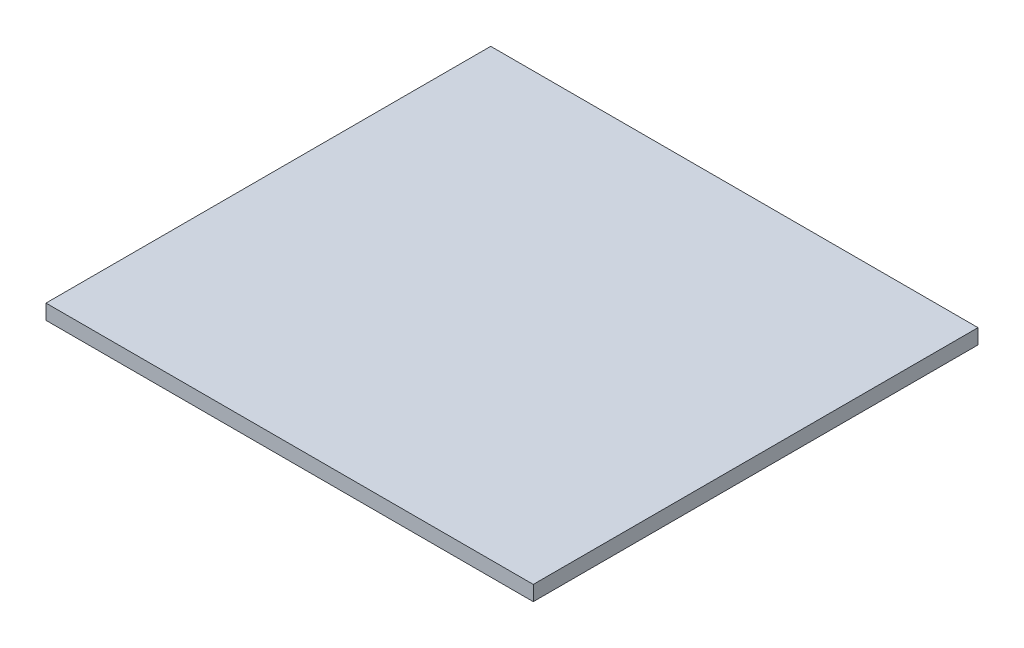
ISO-10303-21;
HEADER;
FILE_DESCRIPTION(('STEP AP214'),'2;1');
FILE_NAME('part.step','',(''),(''),'','','');
FILE_SCHEMA(('AUTOMOTIVE_DESIGN { 1 0 10303 214 1 1 1 1 }'));
ENDSEC;
DATA;
#1=APPLICATION_CONTEXT('core data for automotive mechanical design processes');
#2=APPLICATION_PROTOCOL_DEFINITION('international standard','automotive_design',2000,#1);
#3=PRODUCT_CONTEXT('',#1,'mechanical');
#4=PRODUCT('Part','Part','',(#3));
#5=PRODUCT_RELATED_PRODUCT_CATEGORY('part','',(#4));
#6=PRODUCT_DEFINITION_FORMATION('','',#4);
#7=PRODUCT_DEFINITION_CONTEXT('part definition',#1,'design');
#8=PRODUCT_DEFINITION('design','',#6,#7);
#9=PRODUCT_DEFINITION_SHAPE('','',#8);
#10=(LENGTH_UNIT() NAMED_UNIT(*) SI_UNIT(.MILLI.,.METRE.));
#11=(NAMED_UNIT(*) PLANE_ANGLE_UNIT() SI_UNIT($,.RADIAN.));
#12=(NAMED_UNIT(*) SI_UNIT($,.STERADIAN.) SOLID_ANGLE_UNIT());
#13=UNCERTAINTY_MEASURE_WITH_UNIT(LENGTH_MEASURE(1.E-05),#10,'distance_accuracy_value','');
#14=(GEOMETRIC_REPRESENTATION_CONTEXT(3) GLOBAL_UNCERTAINTY_ASSIGNED_CONTEXT((#13)) GLOBAL_UNIT_ASSIGNED_CONTEXT((#10,
#11,#12)) REPRESENTATION_CONTEXT('',''));
#15=CARTESIAN_POINT('',(0.,0.,0.));
#16=DIRECTION('',(0.,0.,1.));
#17=DIRECTION('',(1.,0.,0.));
#18=AXIS2_PLACEMENT_3D('',#15,#16,#17);
#19=CARTESIAN_POINT('',(0.,6.35,0.));
#20=DIRECTION('',(1.,0.,0.));
#21=DIRECTION('',(0.,0.,-1.));
#22=AXIS2_PLACEMENT_3D('',#19,#20,#21);
#23=PLANE('',#22);
#24=DIRECTION('',(0.,0.,1.));
#25=VECTOR('',#24,1.);
#26=CARTESIAN_POINT('',(0.,0.,0.));
#27=LINE('',#26,#25);
#28=CARTESIAN_POINT('',(0.,0.,-188.468));
#29=VERTEX_POINT('',#28);
#30=CARTESIAN_POINT('',(0.,0.,0.));
#31=VERTEX_POINT('',#30);
#32=EDGE_CURVE('E96',#29,#31,#27,.T.);
#33=ORIENTED_EDGE('',*,*,#32,.T.);
#34=DIRECTION('',(0.,-1.,0.));
#35=VECTOR('',#34,1.);
#36=CARTESIAN_POINT('',(0.,6.35,0.));
#37=LINE('',#36,#35);
#38=CARTESIAN_POINT('',(0.,6.35,0.));
#39=VERTEX_POINT('',#38);
#40=EDGE_CURVE('E11',#39,#31,#37,.T.);
#41=ORIENTED_EDGE('',*,*,#40,.F.);
#42=DIRECTION('',(0.,0.,1.));
#43=VECTOR('',#42,1.);
#44=CARTESIAN_POINT('',(0.,6.35,0.));
#45=LINE('',#44,#43);
#46=CARTESIAN_POINT('',(0.,6.35,-188.468));
#47=VERTEX_POINT('',#46);
#48=EDGE_CURVE('E84',#47,#39,#45,.T.);
#49=ORIENTED_EDGE('',*,*,#48,.F.);
#50=DIRECTION('',(0.,-1.,0.));
#51=VECTOR('',#50,1.);
#52=CARTESIAN_POINT('',(0.,6.35,-188.468));
#53=LINE('',#52,#51);
#54=EDGE_CURVE('E92',#47,#29,#53,.T.);
#55=ORIENTED_EDGE('',*,*,#54,.T.);
#56=EDGE_LOOP('',(#33,#41,#49,#55));
#57=FACE_BOUND('',#56,.T.);
#58=ADVANCED_FACE('F33',(#57),#23,.F.);
#59=CARTESIAN_POINT('',(0.,6.35,0.));
#60=DIRECTION('',(0.,0.,-1.));
#61=DIRECTION('',(-1.,0.,0.));
#62=AXIS2_PLACEMENT_3D('',#59,#60,#61);
#63=PLANE('',#62);
#64=DIRECTION('',(1.,0.,0.));
#65=VECTOR('',#64,1.);
#66=CARTESIAN_POINT('',(0.,0.,0.));
#67=LINE('',#66,#65);
#68=CARTESIAN_POINT('',(206.502,0.,0.));
#69=VERTEX_POINT('',#68);
#70=EDGE_CURVE('E88',#31,#69,#67,.T.);
#71=ORIENTED_EDGE('',*,*,#70,.T.);
#72=DIRECTION('',(0.,-1.,0.));
#73=VECTOR('',#72,1.);
#74=CARTESIAN_POINT('',(206.502,6.35,0.));
#75=LINE('',#74,#73);
#76=CARTESIAN_POINT('',(206.502,6.35,0.));
#77=VERTEX_POINT('',#76);
#78=EDGE_CURVE('E41',#77,#69,#75,.T.);
#79=ORIENTED_EDGE('',*,*,#78,.F.);
#80=DIRECTION('',(1.,0.,0.));
#81=VECTOR('',#80,1.);
#82=CARTESIAN_POINT('',(0.,6.35,0.));
#83=LINE('',#82,#81);
#84=EDGE_CURVE('E79',#39,#77,#83,.T.);
#85=ORIENTED_EDGE('',*,*,#84,.F.);
#86=ORIENTED_EDGE('',*,*,#40,.T.);
#87=EDGE_LOOP('',(#71,#79,#85,#86));
#88=FACE_BOUND('',#87,.T.);
#89=ADVANCED_FACE('F87',(#88),#63,.F.);
#90=CARTESIAN_POINT('',(206.502,6.35,0.));
#91=DIRECTION('',(-1.,0.,0.));
#92=DIRECTION('',(0.,0.,1.));
#93=AXIS2_PLACEMENT_3D('',#90,#91,#92);
#94=PLANE('',#93);
#95=DIRECTION('',(0.,0.,-1.));
#96=VECTOR('',#95,1.);
#97=CARTESIAN_POINT('',(206.502,0.,0.));
#98=LINE('',#97,#96);
#99=CARTESIAN_POINT('',(206.502,0.,-188.468));
#100=VERTEX_POINT('',#99);
#101=EDGE_CURVE('E66',#69,#100,#98,.T.);
#102=ORIENTED_EDGE('',*,*,#101,.T.);
#103=DIRECTION('',(0.,-1.,0.));
#104=VECTOR('',#103,1.);
#105=CARTESIAN_POINT('',(206.502,6.35,-188.468));
#106=LINE('',#105,#104);
#107=CARTESIAN_POINT('',(206.502,6.35,-188.468));
#108=VERTEX_POINT('',#107);
#109=EDGE_CURVE('E89',#108,#100,#106,.T.);
#110=ORIENTED_EDGE('',*,*,#109,.F.);
#111=DIRECTION('',(0.,0.,-1.));
#112=VECTOR('',#111,1.);
#113=CARTESIAN_POINT('',(206.502,6.35,0.));
#114=LINE('',#113,#112);
#115=EDGE_CURVE('E82',#77,#108,#114,.T.);
#116=ORIENTED_EDGE('',*,*,#115,.F.);
#117=ORIENTED_EDGE('',*,*,#78,.T.);
#118=EDGE_LOOP('',(#102,#110,#116,#117));
#119=FACE_BOUND('',#118,.T.);
#120=ADVANCED_FACE('F90',(#119),#94,.F.);
#121=CARTESIAN_POINT('',(0.,6.35,-188.468));
#122=DIRECTION('',(0.,0.,1.));
#123=DIRECTION('',(1.,0.,0.));
#124=AXIS2_PLACEMENT_3D('',#121,#122,#123);
#125=PLANE('',#124);
#126=DIRECTION('',(-1.,0.,0.));
#127=VECTOR('',#126,1.);
#128=CARTESIAN_POINT('',(0.,0.,-188.468));
#129=LINE('',#128,#127);
#130=EDGE_CURVE('E72',#100,#29,#129,.T.);
#131=ORIENTED_EDGE('',*,*,#130,.T.);
#132=ORIENTED_EDGE('',*,*,#54,.F.);
#133=DIRECTION('',(-1.,0.,0.));
#134=VECTOR('',#133,1.);
#135=CARTESIAN_POINT('',(0.,6.35,-188.468));
#136=LINE('',#135,#134);
#137=EDGE_CURVE('E49',#108,#47,#136,.T.);
#138=ORIENTED_EDGE('',*,*,#137,.F.);
#139=ORIENTED_EDGE('',*,*,#109,.T.);
#140=EDGE_LOOP('',(#131,#132,#138,#139));
#141=FACE_BOUND('',#140,.T.);
#142=ADVANCED_FACE('F103',(#141),#125,.F.);
#143=CARTESIAN_POINT('',(0.,6.35,0.));
#144=DIRECTION('',(0.,-1.,0.));
#145=DIRECTION('',(0.,0.,-1.));
#146=AXIS2_PLACEMENT_3D('',#143,#144,#145);
#147=PLANE('',#146);
#148=ORIENTED_EDGE('',*,*,#48,.T.);
#149=ORIENTED_EDGE('',*,*,#84,.T.);
#150=ORIENTED_EDGE('',*,*,#115,.T.);
#151=ORIENTED_EDGE('',*,*,#137,.T.);
#152=EDGE_LOOP('',(#148,#149,#150,#151));
#153=FACE_BOUND('',#152,.T.);
#154=ADVANCED_FACE('F80',(#153),#147,.F.);
#155=CARTESIAN_POINT('',(0.,0.,0.));
#156=DIRECTION('',(0.,-1.,0.));
#157=DIRECTION('',(0.,0.,-1.));
#158=AXIS2_PLACEMENT_3D('',#155,#156,#157);
#159=PLANE('',#158);
#160=ORIENTED_EDGE('',*,*,#32,.F.);
#161=ORIENTED_EDGE('',*,*,#130,.F.);
#162=ORIENTED_EDGE('',*,*,#101,.F.);
#163=ORIENTED_EDGE('',*,*,#70,.F.);
#164=EDGE_LOOP('',(#160,#161,#162,#163));
#165=FACE_BOUND('',#164,.T.);
#166=ADVANCED_FACE('F106',(#165),#159,.T.);
#167=CLOSED_SHELL('',(#58,#89,#120,#142,#154,#166));
#168=MANIFOLD_SOLID_BREP('B2',#167);
#169=ADVANCED_BREP_SHAPE_REPRESENTATION('',(#18,#168),#14);
#170=SHAPE_DEFINITION_REPRESENTATION(#9,#169);
ENDSEC;
END-ISO-10303-21;
